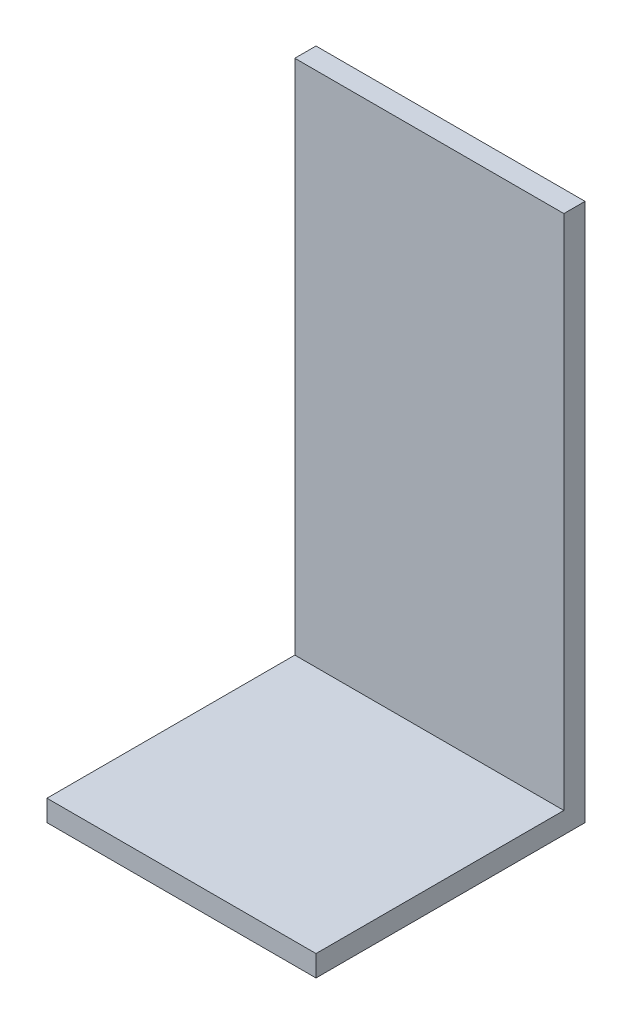
ISO-10303-21;
HEADER;
FILE_DESCRIPTION(('STEP AP214'),'2;1');
FILE_NAME('part.step','',(''),(''),'','','');
FILE_SCHEMA(('AUTOMOTIVE_DESIGN { 1 0 10303 214 1 1 1 1 }'));
ENDSEC;
DATA;
#1=APPLICATION_CONTEXT('core data for automotive mechanical design processes');
#2=APPLICATION_PROTOCOL_DEFINITION('international standard','automotive_design',2000,#1);
#3=PRODUCT_CONTEXT('',#1,'mechanical');
#4=PRODUCT('Part','Part','',(#3));
#5=PRODUCT_RELATED_PRODUCT_CATEGORY('part','',(#4));
#6=PRODUCT_DEFINITION_FORMATION('','',#4);
#7=PRODUCT_DEFINITION_CONTEXT('part definition',#1,'design');
#8=PRODUCT_DEFINITION('design','',#6,#7);
#9=PRODUCT_DEFINITION_SHAPE('','',#8);
#10=(LENGTH_UNIT() NAMED_UNIT(*) SI_UNIT(.MILLI.,.METRE.));
#11=(NAMED_UNIT(*) PLANE_ANGLE_UNIT() SI_UNIT($,.RADIAN.));
#12=(NAMED_UNIT(*) SI_UNIT($,.STERADIAN.) SOLID_ANGLE_UNIT());
#13=UNCERTAINTY_MEASURE_WITH_UNIT(LENGTH_MEASURE(1.E-05),#10,'distance_accuracy_value','');
#14=(GEOMETRIC_REPRESENTATION_CONTEXT(3) GLOBAL_UNCERTAINTY_ASSIGNED_CONTEXT((#13)) GLOBAL_UNIT_ASSIGNED_CONTEXT((#10,
#11,#12)) REPRESENTATION_CONTEXT('',''));
#15=CARTESIAN_POINT('',(0.,0.,0.));
#16=DIRECTION('',(0.,0.,1.));
#17=DIRECTION('',(1.,0.,0.));
#18=AXIS2_PLACEMENT_3D('',#15,#16,#17);
#19=CARTESIAN_POINT('',(-13.1204090157025,2.,-11.1245177793984));
#20=DIRECTION('',(1.,0.,0.));
#21=DIRECTION('',(0.,0.,-1.));
#22=AXIS2_PLACEMENT_3D('',#19,#20,#21);
#23=PLANE('',#22);
#24=DIRECTION('',(0.,0.,1.));
#25=VECTOR('',#24,1.);
#26=CARTESIAN_POINT('',(-13.1204090157025,0.,-11.1245177793984));
#27=LINE('',#26,#25);
#28=CARTESIAN_POINT('',(-13.1204090157025,0.,-11.1245177793984));
#29=VERTEX_POINT('',#28);
#30=CARTESIAN_POINT('',(-13.1204090157025,0.,14.2754822206016));
#31=VERTEX_POINT('',#30);
#32=EDGE_CURVE('E93',#29,#31,#27,.T.);
#33=ORIENTED_EDGE('',*,*,#32,.T.);
#34=DIRECTION('',(0.,-1.,0.));
#35=VECTOR('',#34,1.);
#36=CARTESIAN_POINT('',(-13.1204090157025,2.,14.2754822206016));
#37=LINE('',#36,#35);
#38=CARTESIAN_POINT('',(-13.1204090157025,2.,14.2754822206016));
#39=VERTEX_POINT('',#38);
#40=EDGE_CURVE('E11',#39,#31,#37,.T.);
#41=ORIENTED_EDGE('',*,*,#40,.F.);
#42=DIRECTION('',(0.,0.,1.));
#43=VECTOR('',#42,1.);
#44=CARTESIAN_POINT('',(-13.1204090157025,2.,-11.1245177793984));
#45=LINE('',#44,#43);
#46=CARTESIAN_POINT('',(-13.1204090157025,2.,-9.12451777939839));
#47=VERTEX_POINT('',#46);
#48=EDGE_CURVE('E86',#47,#39,#45,.T.);
#49=ORIENTED_EDGE('',*,*,#48,.F.);
#50=DIRECTION('',(0.,-1.,0.));
#51=VECTOR('',#50,1.);
#52=CARTESIAN_POINT('',(-13.1204090157025,50.8,-9.12451777939839));
#53=LINE('',#52,#51);
#54=CARTESIAN_POINT('',(-13.1204090157025,50.8,-9.12451777939839));
#55=VERTEX_POINT('',#54);
#56=EDGE_CURVE('E101',#55,#47,#53,.T.);
#57=ORIENTED_EDGE('',*,*,#56,.F.);
#58=DIRECTION('',(0.,0.,1.));
#59=VECTOR('',#58,1.);
#60=CARTESIAN_POINT('',(-13.1204090157025,50.8,-11.1245177793984));
#61=LINE('',#60,#59);
#62=CARTESIAN_POINT('',(-13.1204090157025,50.8,-11.1245177793984));
#63=VERTEX_POINT('',#62);
#64=EDGE_CURVE('E96',#63,#55,#61,.T.);
#65=ORIENTED_EDGE('',*,*,#64,.F.);
#66=DIRECTION('',(0.,-1.,0.));
#67=VECTOR('',#66,1.);
#68=CARTESIAN_POINT('',(-13.1204090157025,2.,-11.1245177793984));
#69=LINE('',#68,#67);
#70=EDGE_CURVE('E79',#63,#29,#69,.T.);
#71=ORIENTED_EDGE('',*,*,#70,.T.);
#72=EDGE_LOOP('',(#33,#41,#49,#57,#65,#71));
#73=FACE_BOUND('',#72,.T.);
#74=ADVANCED_FACE('F33',(#73),#23,.F.);
#75=CARTESIAN_POINT('',(-13.1204090157025,2.,14.2754822206016));
#76=DIRECTION('',(0.,0.,-1.));
#77=DIRECTION('',(-1.,0.,0.));
#78=AXIS2_PLACEMENT_3D('',#75,#76,#77);
#79=PLANE('',#78);
#80=DIRECTION('',(1.,0.,0.));
#81=VECTOR('',#80,1.);
#82=CARTESIAN_POINT('',(-13.1204090157025,0.,14.2754822206016));
#83=LINE('',#82,#81);
#84=CARTESIAN_POINT('',(12.2795909842975,0.,14.2754822206016));
#85=VERTEX_POINT('',#84);
#86=EDGE_CURVE('E100',#31,#85,#83,.T.);
#87=ORIENTED_EDGE('',*,*,#86,.T.);
#88=DIRECTION('',(0.,-1.,0.));
#89=VECTOR('',#88,1.);
#90=CARTESIAN_POINT('',(12.2795909842975,2.,14.2754822206016));
#91=LINE('',#90,#89);
#92=CARTESIAN_POINT('',(12.2795909842975,2.,14.2754822206016));
#93=VERTEX_POINT('',#92);
#94=EDGE_CURVE('E41',#93,#85,#91,.T.);
#95=ORIENTED_EDGE('',*,*,#94,.F.);
#96=DIRECTION('',(1.,0.,0.));
#97=VECTOR('',#96,1.);
#98=CARTESIAN_POINT('',(-13.1204090157025,2.,14.2754822206016));
#99=LINE('',#98,#97);
#100=EDGE_CURVE('E55',#39,#93,#99,.T.);
#101=ORIENTED_EDGE('',*,*,#100,.F.);
#102=ORIENTED_EDGE('',*,*,#40,.T.);
#103=EDGE_LOOP('',(#87,#95,#101,#102));
#104=FACE_BOUND('',#103,.T.);
#105=ADVANCED_FACE('F149',(#104),#79,.F.);
#106=CARTESIAN_POINT('',(12.2795909842975,2.,-11.1245177793984));
#107=DIRECTION('',(-1.,0.,0.));
#108=DIRECTION('',(0.,0.,1.));
#109=AXIS2_PLACEMENT_3D('',#106,#107,#108);
#110=PLANE('',#109);
#111=DIRECTION('',(0.,0.,-1.));
#112=VECTOR('',#111,1.);
#113=CARTESIAN_POINT('',(12.2795909842975,0.,-11.1245177793984));
#114=LINE('',#113,#112);
#115=CARTESIAN_POINT('',(12.2795909842975,0.,-11.1245177793984));
#116=VERTEX_POINT('',#115);
#117=EDGE_CURVE('E87',#85,#116,#114,.T.);
#118=ORIENTED_EDGE('',*,*,#117,.T.);
#119=DIRECTION('',(0.,-1.,0.));
#120=VECTOR('',#119,1.);
#121=CARTESIAN_POINT('',(12.2795909842975,2.,-11.1245177793984));
#122=LINE('',#121,#120);
#123=CARTESIAN_POINT('',(12.2795909842975,50.8,-11.1245177793984));
#124=VERTEX_POINT('',#123);
#125=EDGE_CURVE('E82',#124,#116,#122,.T.);
#126=ORIENTED_EDGE('',*,*,#125,.F.);
#127=DIRECTION('',(0.,0.,-1.));
#128=VECTOR('',#127,1.);
#129=CARTESIAN_POINT('',(12.2795909842975,50.8,-11.1245177793984));
#130=LINE('',#129,#128);
#131=CARTESIAN_POINT('',(12.2795909842975,50.8,-9.12451777939839));
#132=VERTEX_POINT('',#131);
#133=EDGE_CURVE('E135',#132,#124,#130,.T.);
#134=ORIENTED_EDGE('',*,*,#133,.F.);
#135=DIRECTION('',(0.,-1.,0.));
#136=VECTOR('',#135,1.);
#137=CARTESIAN_POINT('',(12.2795909842975,50.8,-9.12451777939839));
#138=LINE('',#137,#136);
#139=CARTESIAN_POINT('',(12.2795909842975,2.,-9.12451777939839));
#140=VERTEX_POINT('',#139);
#141=EDGE_CURVE('E105',#132,#140,#138,.T.);
#142=ORIENTED_EDGE('',*,*,#141,.T.);
#143=DIRECTION('',(0.,0.,-1.));
#144=VECTOR('',#143,1.);
#145=CARTESIAN_POINT('',(12.2795909842975,2.,-11.1245177793984));
#146=LINE('',#145,#144);
#147=EDGE_CURVE('E97',#93,#140,#146,.T.);
#148=ORIENTED_EDGE('',*,*,#147,.F.);
#149=ORIENTED_EDGE('',*,*,#94,.T.);
#150=EDGE_LOOP('',(#118,#126,#134,#142,#148,#149));
#151=FACE_BOUND('',#150,.T.);
#152=ADVANCED_FACE('F133',(#151),#110,.F.);
#153=CARTESIAN_POINT('',(-13.1204090157025,2.,-11.1245177793984));
#154=DIRECTION('',(0.,0.,1.));
#155=DIRECTION('',(1.,0.,0.));
#156=AXIS2_PLACEMENT_3D('',#153,#154,#155);
#157=PLANE('',#156);
#158=DIRECTION('',(-1.,0.,0.));
#159=VECTOR('',#158,1.);
#160=CARTESIAN_POINT('',(-13.1204090157025,0.,-11.1245177793984));
#161=LINE('',#160,#159);
#162=EDGE_CURVE('E75',#116,#29,#161,.T.);
#163=ORIENTED_EDGE('',*,*,#162,.T.);
#164=ORIENTED_EDGE('',*,*,#70,.F.);
#165=DIRECTION('',(-1.,0.,0.));
#166=VECTOR('',#165,1.);
#167=CARTESIAN_POINT('',(-13.1204090157025,50.8,-11.1245177793984));
#168=LINE('',#167,#166);
#169=EDGE_CURVE('E136',#124,#63,#168,.T.);
#170=ORIENTED_EDGE('',*,*,#169,.F.);
#171=ORIENTED_EDGE('',*,*,#125,.T.);
#172=EDGE_LOOP('',(#163,#164,#170,#171));
#173=FACE_BOUND('',#172,.T.);
#174=ADVANCED_FACE('F77',(#173),#157,.F.);
#175=CARTESIAN_POINT('',(0.,2.,0.));
#176=DIRECTION('',(0.,1.,0.));
#177=DIRECTION('',(0.,0.,1.));
#178=AXIS2_PLACEMENT_3D('',#175,#176,#177);
#179=PLANE('',#178);
#180=DIRECTION('',(1.,0.,0.));
#181=VECTOR('',#180,1.);
#182=CARTESIAN_POINT('',(-13.1204090157025,2.,-9.12451777939839));
#183=LINE('',#182,#181);
#184=EDGE_CURVE('E49',#47,#140,#183,.T.);
#185=ORIENTED_EDGE('',*,*,#184,.F.);
#186=ORIENTED_EDGE('',*,*,#48,.T.);
#187=ORIENTED_EDGE('',*,*,#100,.T.);
#188=ORIENTED_EDGE('',*,*,#147,.T.);
#189=EDGE_LOOP('',(#185,#186,#187,#188));
#190=FACE_BOUND('',#189,.T.);
#191=ADVANCED_FACE('F123',(#190),#179,.T.);
#192=CARTESIAN_POINT('',(0.,0.,0.));
#193=DIRECTION('',(0.,1.,0.));
#194=DIRECTION('',(0.,0.,1.));
#195=AXIS2_PLACEMENT_3D('',#192,#193,#194);
#196=PLANE('',#195);
#197=ORIENTED_EDGE('',*,*,#32,.F.);
#198=ORIENTED_EDGE('',*,*,#162,.F.);
#199=ORIENTED_EDGE('',*,*,#117,.F.);
#200=ORIENTED_EDGE('',*,*,#86,.F.);
#201=EDGE_LOOP('',(#197,#198,#199,#200));
#202=FACE_BOUND('',#201,.T.);
#203=ADVANCED_FACE('F99',(#202),#196,.F.);
#204=CARTESIAN_POINT('',(-13.1204090157025,50.8,-9.12451777939839));
#205=DIRECTION('',(0.,0.,-1.));
#206=DIRECTION('',(-1.,0.,0.));
#207=AXIS2_PLACEMENT_3D('',#204,#205,#206);
#208=PLANE('',#207);
#209=ORIENTED_EDGE('',*,*,#184,.T.);
#210=ORIENTED_EDGE('',*,*,#141,.F.);
#211=DIRECTION('',(1.,0.,0.));
#212=VECTOR('',#211,1.);
#213=CARTESIAN_POINT('',(-13.1204090157025,50.8,-9.12451777939839));
#214=LINE('',#213,#212);
#215=EDGE_CURVE('E141',#55,#132,#214,.T.);
#216=ORIENTED_EDGE('',*,*,#215,.F.);
#217=ORIENTED_EDGE('',*,*,#56,.T.);
#218=EDGE_LOOP('',(#209,#210,#216,#217));
#219=FACE_BOUND('',#218,.T.);
#220=ADVANCED_FACE('F129',(#219),#208,.F.);
#221=CARTESIAN_POINT('',(0.,50.8,0.));
#222=DIRECTION('',(0.,1.,0.));
#223=DIRECTION('',(0.,0.,1.));
#224=AXIS2_PLACEMENT_3D('',#221,#222,#223);
#225=PLANE('',#224);
#226=ORIENTED_EDGE('',*,*,#64,.T.);
#227=ORIENTED_EDGE('',*,*,#215,.T.);
#228=ORIENTED_EDGE('',*,*,#133,.T.);
#229=ORIENTED_EDGE('',*,*,#169,.T.);
#230=EDGE_LOOP('',(#226,#227,#228,#229));
#231=FACE_BOUND('',#230,.T.);
#232=ADVANCED_FACE('F146',(#231),#225,.T.);
#233=CLOSED_SHELL('',(#74,#105,#152,#174,#191,#203,#220,#232));
#234=MANIFOLD_SOLID_BREP('B2',#233);
#235=ADVANCED_BREP_SHAPE_REPRESENTATION('',(#18,#234),#14);
#236=SHAPE_DEFINITION_REPRESENTATION(#9,#235);
ENDSEC;
END-ISO-10303-21;
